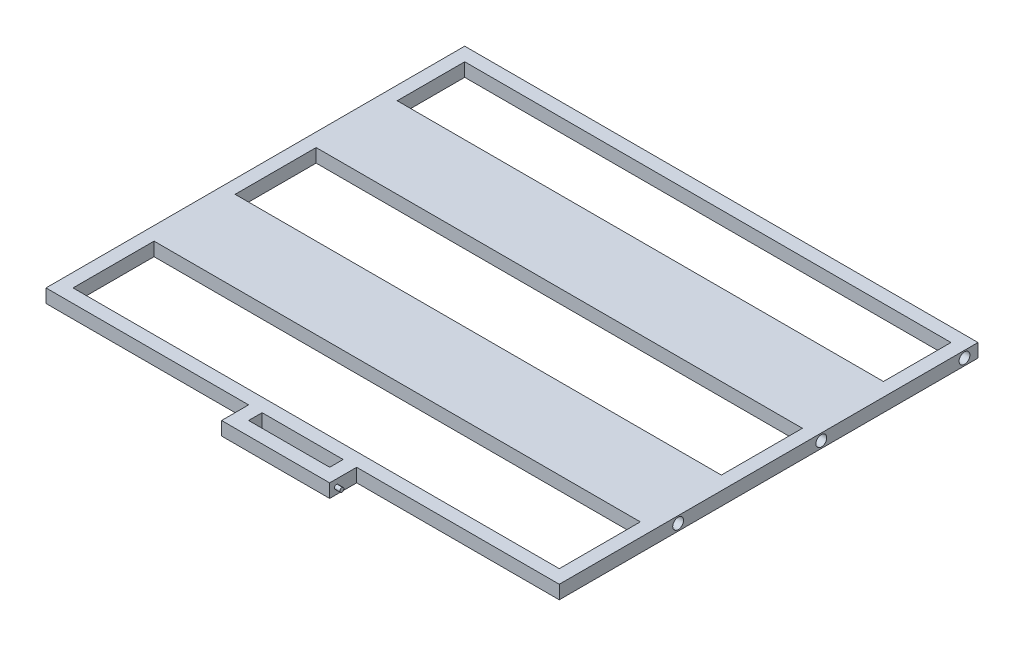
ISO-10303-21;
HEADER;
FILE_DESCRIPTION(('STEP AP214'),'2;1');
FILE_NAME('part.step','',(''),(''),'','','');
FILE_SCHEMA(('AUTOMOTIVE_DESIGN { 1 0 10303 214 1 1 1 1 }'));
ENDSEC;
DATA;
#1=APPLICATION_CONTEXT('core data for automotive mechanical design processes');
#2=APPLICATION_PROTOCOL_DEFINITION('international standard','automotive_design',2000,#1);
#3=PRODUCT_CONTEXT('',#1,'mechanical');
#4=PRODUCT('Part','Part','',(#3));
#5=PRODUCT_RELATED_PRODUCT_CATEGORY('part','',(#4));
#6=PRODUCT_DEFINITION_FORMATION('','',#4);
#7=PRODUCT_DEFINITION_CONTEXT('part definition',#1,'design');
#8=PRODUCT_DEFINITION('design','',#6,#7);
#9=PRODUCT_DEFINITION_SHAPE('','',#8);
#10=(LENGTH_UNIT() NAMED_UNIT(*) SI_UNIT(.MILLI.,.METRE.));
#11=(NAMED_UNIT(*) PLANE_ANGLE_UNIT() SI_UNIT($,.RADIAN.));
#12=(NAMED_UNIT(*) SI_UNIT($,.STERADIAN.) SOLID_ANGLE_UNIT());
#13=UNCERTAINTY_MEASURE_WITH_UNIT(LENGTH_MEASURE(1.E-05),#10,'distance_accuracy_value','');
#14=(GEOMETRIC_REPRESENTATION_CONTEXT(3) GLOBAL_UNCERTAINTY_ASSIGNED_CONTEXT((#13)) GLOBAL_UNIT_ASSIGNED_CONTEXT((#10,
#11,#12)) REPRESENTATION_CONTEXT('',''));
#15=CARTESIAN_POINT('',(0.,0.,0.));
#16=DIRECTION('',(0.,0.,1.));
#17=DIRECTION('',(1.,0.,0.));
#18=AXIS2_PLACEMENT_3D('',#15,#16,#17);
#19=CARTESIAN_POINT('',(450.,25.,0.));
#20=DIRECTION('',(-1.,0.,0.));
#21=DIRECTION('',(0.,0.,1.));
#22=AXIS2_PLACEMENT_3D('',#19,#20,#21);
#23=PLANE('',#22);
#24=DIRECTION('',(0.,0.,-1.));
#25=VECTOR('',#24,1.);
#26=CARTESIAN_POINT('',(450.,25.,0.));
#27=LINE('',#26,#25);
#28=CARTESIAN_POINT('',(450.000000000001,25.,-225.));
#29=VERTEX_POINT('',#28);
#30=CARTESIAN_POINT('',(450.,25.,-350.));
#31=VERTEX_POINT('',#30);
#32=EDGE_CURVE('E237',#29,#31,#27,.T.);
#33=ORIENTED_EDGE('',*,*,#32,.T.);
#34=DIRECTION('',(0.,-1.,0.));
#35=VECTOR('',#34,1.);
#36=CARTESIAN_POINT('',(450.,25.,-350.));
#37=LINE('',#36,#35);
#38=CARTESIAN_POINT('',(450.,0.,-350.));
#39=VERTEX_POINT('',#38);
#40=EDGE_CURVE('E390',#31,#39,#37,.T.);
#41=ORIENTED_EDGE('',*,*,#40,.T.);
#42=DIRECTION('',(0.,0.,-1.));
#43=VECTOR('',#42,1.);
#44=CARTESIAN_POINT('',(450.,0.,0.));
#45=LINE('',#44,#43);
#46=CARTESIAN_POINT('',(450.000000000001,0.,-225.));
#47=VERTEX_POINT('',#46);
#48=EDGE_CURVE('E284',#47,#39,#45,.T.);
#49=ORIENTED_EDGE('',*,*,#48,.F.);
#50=DIRECTION('',(0.,-1.,0.));
#51=VECTOR('',#50,1.);
#52=CARTESIAN_POINT('',(450.000000000001,25.,-225.));
#53=LINE('',#52,#51);
#54=EDGE_CURVE('E325',#29,#47,#53,.T.);
#55=ORIENTED_EDGE('',*,*,#54,.F.);
#56=EDGE_LOOP('',(#33,#41,#49,#55));
#57=FACE_BOUND('',#56,.T.);
#58=ADVANCED_FACE('F35',(#57),#23,.T.);
#59=CARTESIAN_POINT('',(-450.,25.,0.));
#60=DIRECTION('',(-1.,0.,0.));
#61=DIRECTION('',(0.,0.,1.));
#62=AXIS2_PLACEMENT_3D('',#59,#60,#61);
#63=PLANE('',#62);
#64=DIRECTION('',(0.,-1.,0.));
#65=VECTOR('',#64,1.);
#66=CARTESIAN_POINT('',(-450.,0.,-350.));
#67=LINE('',#66,#65);
#68=CARTESIAN_POINT('',(-450.,25.,-350.));
#69=VERTEX_POINT('',#68);
#70=CARTESIAN_POINT('',(-450.,0.,-350.));
#71=VERTEX_POINT('',#70);
#72=EDGE_CURVE('E60',#69,#71,#67,.T.);
#73=ORIENTED_EDGE('',*,*,#72,.F.);
#74=DIRECTION('',(0.,0.,-1.));
#75=VECTOR('',#74,1.);
#76=CARTESIAN_POINT('',(-450.,25.,0.));
#77=LINE('',#76,#75);
#78=CARTESIAN_POINT('',(-449.999999999999,25.,-225.));
#79=VERTEX_POINT('',#78);
#80=EDGE_CURVE('E245',#79,#69,#77,.T.);
#81=ORIENTED_EDGE('',*,*,#80,.F.);
#82=DIRECTION('',(0.,-1.,0.));
#83=VECTOR('',#82,1.);
#84=CARTESIAN_POINT('',(-449.999999999999,25.,-225.));
#85=LINE('',#84,#83);
#86=CARTESIAN_POINT('',(-449.999999999999,0.,-225.));
#87=VERTEX_POINT('',#86);
#88=EDGE_CURVE('E331',#79,#87,#85,.T.);
#89=ORIENTED_EDGE('',*,*,#88,.T.);
#90=DIRECTION('',(0.,0.,-1.));
#91=VECTOR('',#90,1.);
#92=CARTESIAN_POINT('',(-450.,0.,0.));
#93=LINE('',#92,#91);
#94=EDGE_CURVE('E292',#87,#71,#93,.T.);
#95=ORIENTED_EDGE('',*,*,#94,.T.);
#96=EDGE_LOOP('',(#73,#81,#89,#95));
#97=FACE_BOUND('',#96,.T.);
#98=ADVANCED_FACE('F456',(#97),#63,.F.);
#99=CARTESIAN_POINT('',(75.,25.,0.));
#100=DIRECTION('',(1.,0.,0.));
#101=DIRECTION('',(0.,0.,-1.));
#102=AXIS2_PLACEMENT_3D('',#99,#100,#101);
#103=PLANE('',#102);
#104=DIRECTION('',(0.,0.,1.));
#105=VECTOR('',#104,1.);
#106=CARTESIAN_POINT('',(75.,0.,0.));
#107=LINE('',#106,#105);
#108=CARTESIAN_POINT('',(75.,0.,400.));
#109=VERTEX_POINT('',#108);
#110=CARTESIAN_POINT('',(75.,0.,425.));
#111=VERTEX_POINT('',#110);
#112=EDGE_CURVE('E304',#109,#111,#107,.T.);
#113=ORIENTED_EDGE('',*,*,#112,.T.);
#114=DIRECTION('',(0.,-1.,0.));
#115=VECTOR('',#114,1.);
#116=CARTESIAN_POINT('',(75.,25.,425.));
#117=LINE('',#116,#115);
#118=CARTESIAN_POINT('',(75.,25.,425.));
#119=VERTEX_POINT('',#118);
#120=EDGE_CURVE('E44',#119,#111,#117,.T.);
#121=ORIENTED_EDGE('',*,*,#120,.F.);
#122=DIRECTION('',(0.,0.,1.));
#123=VECTOR('',#122,1.);
#124=CARTESIAN_POINT('',(75.,25.,0.));
#125=LINE('',#124,#123);
#126=CARTESIAN_POINT('',(75.,25.,400.));
#127=VERTEX_POINT('',#126);
#128=EDGE_CURVE('E255',#127,#119,#125,.T.);
#129=ORIENTED_EDGE('',*,*,#128,.F.);
#130=DIRECTION('',(0.,-1.,0.));
#131=VECTOR('',#130,1.);
#132=CARTESIAN_POINT('',(75.,25.,400.));
#133=LINE('',#132,#131);
#134=EDGE_CURVE('E313',#127,#109,#133,.T.);
#135=ORIENTED_EDGE('',*,*,#134,.T.);
#136=EDGE_LOOP('',(#113,#121,#129,#135));
#137=FACE_BOUND('',#136,.T.);
#138=ADVANCED_FACE('F431',(#137),#103,.F.);
#139=CARTESIAN_POINT('',(0.,25.,425.));
#140=DIRECTION('',(0.,0.,-1.));
#141=DIRECTION('',(-1.,0.,0.));
#142=AXIS2_PLACEMENT_3D('',#139,#140,#141);
#143=PLANE('',#142);
#144=DIRECTION('',(1.,0.,0.));
#145=VECTOR('',#144,1.);
#146=CARTESIAN_POINT('',(0.,0.,425.));
#147=LINE('',#146,#145);
#148=CARTESIAN_POINT('',(-75.,0.,425.));
#149=VERTEX_POINT('',#148);
#150=EDGE_CURVE('E307',#149,#111,#147,.T.);
#151=ORIENTED_EDGE('',*,*,#150,.F.);
#152=DIRECTION('',(0.,-1.,0.));
#153=VECTOR('',#152,1.);
#154=CARTESIAN_POINT('',(-75.,25.,425.));
#155=LINE('',#154,#153);
#156=CARTESIAN_POINT('',(-75.,25.,425.));
#157=VERTEX_POINT('',#156);
#158=EDGE_CURVE('E319',#157,#149,#155,.T.);
#159=ORIENTED_EDGE('',*,*,#158,.F.);
#160=DIRECTION('',(1.,0.,0.));
#161=VECTOR('',#160,1.);
#162=CARTESIAN_POINT('',(0.,25.,425.));
#163=LINE('',#162,#161);
#164=EDGE_CURVE('E257',#157,#119,#163,.T.);
#165=ORIENTED_EDGE('',*,*,#164,.T.);
#166=ORIENTED_EDGE('',*,*,#120,.T.);
#167=EDGE_LOOP('',(#151,#159,#165,#166));
#168=FACE_BOUND('',#167,.T.);
#169=ADVANCED_FACE('F436',(#168),#143,.T.);
#170=CARTESIAN_POINT('',(-75.,25.,0.));
#171=DIRECTION('',(1.,0.,0.));
#172=DIRECTION('',(0.,0.,-1.));
#173=AXIS2_PLACEMENT_3D('',#170,#171,#172);
#174=PLANE('',#173);
#175=DIRECTION('',(0.,0.,1.));
#176=VECTOR('',#175,1.);
#177=CARTESIAN_POINT('',(-75.,0.,0.));
#178=LINE('',#177,#176);
#179=CARTESIAN_POINT('',(-75.,0.,400.));
#180=VERTEX_POINT('',#179);
#181=EDGE_CURVE('E310',#180,#149,#178,.T.);
#182=ORIENTED_EDGE('',*,*,#181,.F.);
#183=DIRECTION('',(0.,-1.,0.));
#184=VECTOR('',#183,1.);
#185=CARTESIAN_POINT('',(-75.,25.,400.));
#186=LINE('',#185,#184);
#187=CARTESIAN_POINT('',(-75.,25.,400.));
#188=VERTEX_POINT('',#187);
#189=EDGE_CURVE('E316',#188,#180,#186,.T.);
#190=ORIENTED_EDGE('',*,*,#189,.F.);
#191=DIRECTION('',(0.,0.,1.));
#192=VECTOR('',#191,1.);
#193=CARTESIAN_POINT('',(-75.,25.,0.));
#194=LINE('',#193,#192);
#195=EDGE_CURVE('E260',#188,#157,#194,.T.);
#196=ORIENTED_EDGE('',*,*,#195,.T.);
#197=ORIENTED_EDGE('',*,*,#158,.T.);
#198=EDGE_LOOP('',(#182,#190,#196,#197));
#199=FACE_BOUND('',#198,.T.);
#200=ADVANCED_FACE('F441',(#199),#174,.T.);
#201=CARTESIAN_POINT('',(450.,0.,375.));
#202=VERTEX_POINT('',#201);
#203=CARTESIAN_POINT('',(450.,0.,225.));
#204=VERTEX_POINT('',#203);
#205=EDGE_CURVE('E283',#202,#204,#45,.T.);
#206=ORIENTED_EDGE('',*,*,#205,.F.);
#207=DIRECTION('',(0.,-1.,0.));
#208=VECTOR('',#207,1.);
#209=CARTESIAN_POINT('',(450.,25.,375.));
#210=LINE('',#209,#208);
#211=CARTESIAN_POINT('',(450.,25.,375.));
#212=VERTEX_POINT('',#211);
#213=EDGE_CURVE('E317',#212,#202,#210,.T.);
#214=ORIENTED_EDGE('',*,*,#213,.F.);
#215=CARTESIAN_POINT('',(450.,25.,225.));
#216=VERTEX_POINT('',#215);
#217=EDGE_CURVE('E236',#212,#216,#27,.T.);
#218=ORIENTED_EDGE('',*,*,#217,.T.);
#219=DIRECTION('',(0.,-1.,0.));
#220=VECTOR('',#219,1.);
#221=CARTESIAN_POINT('',(450.,25.,225.));
#222=LINE('',#221,#220);
#223=EDGE_CURVE('E322',#216,#204,#222,.T.);
#224=ORIENTED_EDGE('',*,*,#223,.T.);
#225=EDGE_LOOP('',(#206,#214,#218,#224));
#226=FACE_BOUND('',#225,.T.);
#227=ADVANCED_FACE('F443',(#226),#23,.T.);
#228=CARTESIAN_POINT('',(0.,25.,375.));
#229=DIRECTION('',(0.,0.,-1.));
#230=DIRECTION('',(-1.,0.,0.));
#231=AXIS2_PLACEMENT_3D('',#228,#229,#230);
#232=PLANE('',#231);
#233=DIRECTION('',(1.,0.,0.));
#234=VECTOR('',#233,1.);
#235=CARTESIAN_POINT('',(0.,0.,375.));
#236=LINE('',#235,#234);
#237=CARTESIAN_POINT('',(-450.,0.,375.));
#238=VERTEX_POINT('',#237);
#239=EDGE_CURVE('E298',#238,#202,#236,.T.);
#240=ORIENTED_EDGE('',*,*,#239,.F.);
#241=DIRECTION('',(0.,-1.,0.));
#242=VECTOR('',#241,1.);
#243=CARTESIAN_POINT('',(-450.,25.,375.));
#244=LINE('',#243,#242);
#245=CARTESIAN_POINT('',(-450.,25.,375.));
#246=VERTEX_POINT('',#245);
#247=EDGE_CURVE('E328',#246,#238,#244,.T.);
#248=ORIENTED_EDGE('',*,*,#247,.F.);
#249=DIRECTION('',(1.,0.,0.));
#250=VECTOR('',#249,1.);
#251=CARTESIAN_POINT('',(0.,25.,375.));
#252=LINE('',#251,#250);
#253=EDGE_CURVE('E250',#246,#212,#252,.T.);
#254=ORIENTED_EDGE('',*,*,#253,.T.);
#255=ORIENTED_EDGE('',*,*,#213,.T.);
#256=EDGE_LOOP('',(#240,#248,#254,#255));
#257=FACE_BOUND('',#256,.T.);
#258=ADVANCED_FACE('F449',(#257),#232,.T.);
#259=CARTESIAN_POINT('',(-450.,0.,225.));
#260=VERTEX_POINT('',#259);
#261=EDGE_CURVE('E291',#238,#260,#93,.T.);
#262=ORIENTED_EDGE('',*,*,#261,.T.);
#263=DIRECTION('',(0.,-1.,0.));
#264=VECTOR('',#263,1.);
#265=CARTESIAN_POINT('',(-450.,25.,225.));
#266=LINE('',#265,#264);
#267=CARTESIAN_POINT('',(-450.,25.,225.));
#268=VERTEX_POINT('',#267);
#269=EDGE_CURVE('E324',#268,#260,#266,.T.);
#270=ORIENTED_EDGE('',*,*,#269,.F.);
#271=EDGE_CURVE('E244',#246,#268,#77,.T.);
#272=ORIENTED_EDGE('',*,*,#271,.F.);
#273=ORIENTED_EDGE('',*,*,#247,.T.);
#274=EDGE_LOOP('',(#262,#270,#272,#273));
#275=FACE_BOUND('',#274,.T.);
#276=ADVANCED_FACE('F463',(#275),#63,.F.);
#277=CARTESIAN_POINT('',(0.,25.,-225.));
#278=DIRECTION('',(0.,0.,-1.));
#279=DIRECTION('',(-1.,0.,0.));
#280=AXIS2_PLACEMENT_3D('',#277,#278,#279);
#281=PLANE('',#280);
#282=DIRECTION('',(1.,0.,0.));
#283=VECTOR('',#282,1.);
#284=CARTESIAN_POINT('',(0.,0.,-225.));
#285=LINE('',#284,#283);
#286=EDGE_CURVE('E295',#87,#47,#285,.T.);
#287=ORIENTED_EDGE('',*,*,#286,.F.);
#288=ORIENTED_EDGE('',*,*,#88,.F.);
#289=DIRECTION('',(1.,0.,0.));
#290=VECTOR('',#289,1.);
#291=CARTESIAN_POINT('',(0.,25.,-225.));
#292=LINE('',#291,#290);
#293=EDGE_CURVE('E247',#79,#29,#292,.T.);
#294=ORIENTED_EDGE('',*,*,#293,.T.);
#295=ORIENTED_EDGE('',*,*,#54,.T.);
#296=EDGE_LOOP('',(#287,#288,#294,#295));
#297=FACE_BOUND('',#296,.T.);
#298=ADVANCED_FACE('F468',(#297),#281,.T.);
#299=CARTESIAN_POINT('',(450.,0.,75.0000000000001));
#300=VERTEX_POINT('',#299);
#301=CARTESIAN_POINT('',(450.,0.,-74.9999999999999));
#302=VERTEX_POINT('',#301);
#303=EDGE_CURVE('E279',#300,#302,#45,.T.);
#304=ORIENTED_EDGE('',*,*,#303,.F.);
#305=DIRECTION('',(0.,-1.,0.));
#306=VECTOR('',#305,1.);
#307=CARTESIAN_POINT('',(450.,25.,75.0000000000001));
#308=LINE('',#307,#306);
#309=CARTESIAN_POINT('',(450.,25.,75.0000000000001));
#310=VERTEX_POINT('',#309);
#311=EDGE_CURVE('E333',#310,#300,#308,.T.);
#312=ORIENTED_EDGE('',*,*,#311,.F.);
#313=CARTESIAN_POINT('',(450.,25.,-74.9999999999999));
#314=VERTEX_POINT('',#313);
#315=EDGE_CURVE('E232',#310,#314,#27,.T.);
#316=ORIENTED_EDGE('',*,*,#315,.T.);
#317=DIRECTION('',(0.,-1.,0.));
#318=VECTOR('',#317,1.);
#319=CARTESIAN_POINT('',(450.,25.,-74.9999999999999));
#320=LINE('',#319,#318);
#321=EDGE_CURVE('E335',#314,#302,#320,.T.);
#322=ORIENTED_EDGE('',*,*,#321,.T.);
#323=EDGE_LOOP('',(#304,#312,#316,#322));
#324=FACE_BOUND('',#323,.T.);
#325=ADVANCED_FACE('F452',(#324),#23,.T.);
#326=CARTESIAN_POINT('',(0.,25.,75.0000000000001));
#327=DIRECTION('',(0.,0.,-1.));
#328=DIRECTION('',(-1.,0.,0.));
#329=AXIS2_PLACEMENT_3D('',#326,#327,#328);
#330=PLANE('',#329);
#331=DIRECTION('',(1.,0.,0.));
#332=VECTOR('',#331,1.);
#333=CARTESIAN_POINT('',(0.,0.,75.0000000000001));
#334=LINE('',#333,#332);
#335=CARTESIAN_POINT('',(-450.,0.,75.0000000000001));
#336=VERTEX_POINT('',#335);
#337=EDGE_CURVE('E282',#336,#300,#334,.T.);
#338=ORIENTED_EDGE('',*,*,#337,.F.);
#339=DIRECTION('',(0.,-1.,0.));
#340=VECTOR('',#339,1.);
#341=CARTESIAN_POINT('',(-450.,25.,75.0000000000001));
#342=LINE('',#341,#340);
#343=CARTESIAN_POINT('',(-450.,25.,75.0000000000001));
#344=VERTEX_POINT('',#343);
#345=EDGE_CURVE('E341',#344,#336,#342,.T.);
#346=ORIENTED_EDGE('',*,*,#345,.F.);
#347=DIRECTION('',(1.,0.,0.));
#348=VECTOR('',#347,1.);
#349=CARTESIAN_POINT('',(0.,25.,75.0000000000001));
#350=LINE('',#349,#348);
#351=EDGE_CURVE('E235',#344,#310,#350,.T.);
#352=ORIENTED_EDGE('',*,*,#351,.T.);
#353=ORIENTED_EDGE('',*,*,#311,.T.);
#354=EDGE_LOOP('',(#338,#346,#352,#353));
#355=FACE_BOUND('',#354,.T.);
#356=ADVANCED_FACE('F467',(#355),#330,.T.);
#357=CARTESIAN_POINT('',(-450.,0.,-74.9999999999999));
#358=VERTEX_POINT('',#357);
#359=EDGE_CURVE('E287',#336,#358,#93,.T.);
#360=ORIENTED_EDGE('',*,*,#359,.T.);
#361=DIRECTION('',(0.,-1.,0.));
#362=VECTOR('',#361,1.);
#363=CARTESIAN_POINT('',(-450.,25.,-74.9999999999999));
#364=LINE('',#363,#362);
#365=CARTESIAN_POINT('',(-450.,25.,-74.9999999999999));
#366=VERTEX_POINT('',#365);
#367=EDGE_CURVE('E337',#366,#358,#364,.T.);
#368=ORIENTED_EDGE('',*,*,#367,.F.);
#369=EDGE_CURVE('E240',#344,#366,#77,.T.);
#370=ORIENTED_EDGE('',*,*,#369,.F.);
#371=ORIENTED_EDGE('',*,*,#345,.T.);
#372=EDGE_LOOP('',(#360,#368,#370,#371));
#373=FACE_BOUND('',#372,.T.);
#374=ADVANCED_FACE('F462',(#373),#63,.F.);
#375=CARTESIAN_POINT('',(0.,25.,450.));
#376=DIRECTION('',(0.,0.,-1.));
#377=DIRECTION('',(-1.,0.,0.));
#378=AXIS2_PLACEMENT_3D('',#375,#376,#377);
#379=PLANE('',#378);
#380=DIRECTION('',(1.,0.,0.));
#381=VECTOR('',#380,1.);
#382=CARTESIAN_POINT('',(0.,0.,450.));
#383=LINE('',#382,#381);
#384=CARTESIAN_POINT('',(-100.,0.,450.));
#385=VERTEX_POINT('',#384);
#386=CARTESIAN_POINT('',(100.,0.,450.));
#387=VERTEX_POINT('',#386);
#388=EDGE_CURVE('E263',#385,#387,#383,.T.);
#389=ORIENTED_EDGE('',*,*,#388,.T.);
#390=DIRECTION('',(0.,-1.,0.));
#391=VECTOR('',#390,1.);
#392=CARTESIAN_POINT('',(100.,25.,450.));
#393=LINE('',#392,#391);
#394=CARTESIAN_POINT('',(100.,25.,450.));
#395=VERTEX_POINT('',#394);
#396=EDGE_CURVE('E338',#395,#387,#393,.T.);
#397=ORIENTED_EDGE('',*,*,#396,.F.);
#398=DIRECTION('',(1.,0.,0.));
#399=VECTOR('',#398,1.);
#400=CARTESIAN_POINT('',(0.,25.,450.));
#401=LINE('',#400,#399);
#402=CARTESIAN_POINT('',(-100.,25.,450.));
#403=VERTEX_POINT('',#402);
#404=EDGE_CURVE('E394',#403,#395,#401,.T.);
#405=ORIENTED_EDGE('',*,*,#404,.F.);
#406=DIRECTION('',(0.,-1.,0.));
#407=VECTOR('',#406,1.);
#408=CARTESIAN_POINT('',(-100.,25.,450.));
#409=LINE('',#408,#407);
#410=EDGE_CURVE('E344',#403,#385,#409,.T.);
#411=ORIENTED_EDGE('',*,*,#410,.T.);
#412=EDGE_LOOP('',(#389,#397,#405,#411));
#413=FACE_BOUND('',#412,.T.);
#414=ADVANCED_FACE('F37',(#413),#379,.F.);
#415=CARTESIAN_POINT('',(100.,25.,0.));
#416=DIRECTION('',(-1.,0.,0.));
#417=DIRECTION('',(0.,0.,1.));
#418=AXIS2_PLACEMENT_3D('',#415,#416,#417);
#419=PLANE('',#418);
#420=CARTESIAN_POINT('',(100.,12.5,437.5));
#421=DIRECTION('',(-1.,0.,0.));
#422=DIRECTION('',(0.,0.,1.));
#423=AXIS2_PLACEMENT_3D('',#420,#421,#422);
#424=CIRCLE('',#423,3.74999999999998);
#425=CARTESIAN_POINT('',(100.,12.5,441.25));
#426=VERTEX_POINT('',#425);
#427=EDGE_CURVE('E11',#426,#426,#424,.F.);
#428=ORIENTED_EDGE('',*,*,#427,.F.);
#429=EDGE_LOOP('',(#428));
#430=FACE_BOUND('',#429,.T.);
#431=DIRECTION('',(0.,0.,-1.));
#432=VECTOR('',#431,1.);
#433=CARTESIAN_POINT('',(100.,0.,0.));
#434=LINE('',#433,#432);
#435=CARTESIAN_POINT('',(100.,0.,400.));
#436=VERTEX_POINT('',#435);
#437=EDGE_CURVE('E266',#387,#436,#434,.T.);
#438=ORIENTED_EDGE('',*,*,#437,.T.);
#439=DIRECTION('',(0.,-1.,0.));
#440=VECTOR('',#439,1.);
#441=CARTESIAN_POINT('',(100.,25.,400.));
#442=LINE('',#441,#440);
#443=CARTESIAN_POINT('',(100.,25.,400.));
#444=VERTEX_POINT('',#443);
#445=EDGE_CURVE('E354',#444,#436,#442,.T.);
#446=ORIENTED_EDGE('',*,*,#445,.F.);
#447=DIRECTION('',(0.,0.,-1.));
#448=VECTOR('',#447,1.);
#449=CARTESIAN_POINT('',(100.,25.,0.));
#450=LINE('',#449,#448);
#451=EDGE_CURVE('E225',#395,#444,#450,.T.);
#452=ORIENTED_EDGE('',*,*,#451,.F.);
#453=ORIENTED_EDGE('',*,*,#396,.T.);
#454=EDGE_LOOP('',(#438,#446,#452,#453));
#455=FACE_BOUND('',#454,.T.);
#456=ADVANCED_FACE('F400',(#430,#455),#419,.F.);
#457=CARTESIAN_POINT('',(0.,25.,400.));
#458=DIRECTION('',(0.,0.,-1.));
#459=DIRECTION('',(-1.,0.,0.));
#460=AXIS2_PLACEMENT_3D('',#457,#458,#459);
#461=PLANE('',#460);
#462=DIRECTION('',(1.,0.,0.));
#463=VECTOR('',#462,1.);
#464=CARTESIAN_POINT('',(0.,0.,400.));
#465=LINE('',#464,#463);
#466=CARTESIAN_POINT('',(475.,0.,400.));
#467=VERTEX_POINT('',#466);
#468=EDGE_CURVE('E269',#436,#467,#465,.T.);
#469=ORIENTED_EDGE('',*,*,#468,.T.);
#470=DIRECTION('',(0.,-1.,0.));
#471=VECTOR('',#470,1.);
#472=CARTESIAN_POINT('',(475.,25.,400.));
#473=LINE('',#472,#471);
#474=CARTESIAN_POINT('',(475.,25.,400.));
#475=VERTEX_POINT('',#474);
#476=EDGE_CURVE('E352',#475,#467,#473,.T.);
#477=ORIENTED_EDGE('',*,*,#476,.F.);
#478=DIRECTION('',(1.,0.,0.));
#479=VECTOR('',#478,1.);
#480=CARTESIAN_POINT('',(0.,25.,400.));
#481=LINE('',#480,#479);
#482=EDGE_CURVE('E219',#444,#475,#481,.T.);
#483=ORIENTED_EDGE('',*,*,#482,.F.);
#484=ORIENTED_EDGE('',*,*,#445,.T.);
#485=EDGE_LOOP('',(#469,#477,#483,#484));
#486=FACE_BOUND('',#485,.T.);
#487=ADVANCED_FACE('F403',(#486),#461,.F.);
#488=CARTESIAN_POINT('',(475.,25.,0.));
#489=DIRECTION('',(-1.,0.,0.));
#490=DIRECTION('',(0.,0.,1.));
#491=AXIS2_PLACEMENT_3D('',#488,#489,#490);
#492=PLANE('',#491);
#493=CARTESIAN_POINT('',(475.,12.5,-350.));
#494=DIRECTION('',(1.,0.,0.));
#495=DIRECTION('',(0.,0.,-1.));
#496=AXIS2_PLACEMENT_3D('',#493,#494,#495);
#497=CIRCLE('',#496,10.);
#498=CARTESIAN_POINT('',(475.,12.5,-360.));
#499=VERTEX_POINT('',#498);
#500=EDGE_CURVE('E906',#499,#499,#497,.T.);
#501=ORIENTED_EDGE('',*,*,#500,.F.);
#502=EDGE_LOOP('',(#501));
#503=FACE_BOUND('',#502,.T.);
#504=CARTESIAN_POINT('',(475.,12.4999999999981,-84.9999999999999));
#505=DIRECTION('',(1.,0.,0.));
#506=DIRECTION('',(0.,0.,-1.));
#507=AXIS2_PLACEMENT_3D('',#504,#505,#506);
#508=CIRCLE('',#507,10.);
#509=CARTESIAN_POINT('',(475.,12.4999999999981,-94.9999999999999));
#510=VERTEX_POINT('',#509);
#511=EDGE_CURVE('E376',#510,#510,#508,.T.);
#512=ORIENTED_EDGE('',*,*,#511,.F.);
#513=EDGE_LOOP('',(#512));
#514=FACE_BOUND('',#513,.T.);
#515=CARTESIAN_POINT('',(475.,12.4999999999963,180.));
#516=DIRECTION('',(1.,0.,0.));
#517=DIRECTION('',(0.,0.,-1.));
#518=AXIS2_PLACEMENT_3D('',#515,#516,#517);
#519=CIRCLE('',#518,10.);
#520=CARTESIAN_POINT('',(475.,12.4999999999963,170.));
#521=VERTEX_POINT('',#520);
#522=EDGE_CURVE('E367',#521,#521,#519,.T.);
#523=ORIENTED_EDGE('',*,*,#522,.F.);
#524=EDGE_LOOP('',(#523));
#525=FACE_BOUND('',#524,.T.);
#526=DIRECTION('',(0.,0.,-1.));
#527=VECTOR('',#526,1.);
#528=CARTESIAN_POINT('',(475.,0.,0.));
#529=LINE('',#528,#527);
#530=CARTESIAN_POINT('',(475.,0.,-375.));
#531=VERTEX_POINT('',#530);
#532=EDGE_CURVE('E214',#467,#531,#529,.T.);
#533=ORIENTED_EDGE('',*,*,#532,.T.);
#534=DIRECTION('',(0.,1.,0.));
#535=VECTOR('',#534,1.);
#536=CARTESIAN_POINT('',(475.,25.,-375.));
#537=LINE('',#536,#535);
#538=CARTESIAN_POINT('',(475.,25.,-375.));
#539=VERTEX_POINT('',#538);
#540=EDGE_CURVE('E52',#531,#539,#537,.T.);
#541=ORIENTED_EDGE('',*,*,#540,.T.);
#542=DIRECTION('',(0.,0.,-1.));
#543=VECTOR('',#542,1.);
#544=CARTESIAN_POINT('',(475.,25.,0.));
#545=LINE('',#544,#543);
#546=EDGE_CURVE('E212',#475,#539,#545,.T.);
#547=ORIENTED_EDGE('',*,*,#546,.F.);
#548=ORIENTED_EDGE('',*,*,#476,.T.);
#549=EDGE_LOOP('',(#533,#541,#547,#548));
#550=FACE_BOUND('',#549,.T.);
#551=ADVANCED_FACE('F210',(#503,#514,#525,#550),#492,.F.);
#552=CARTESIAN_POINT('',(-475.,25.,0.));
#553=DIRECTION('',(-1.,0.,0.));
#554=DIRECTION('',(0.,0.,1.));
#555=AXIS2_PLACEMENT_3D('',#552,#553,#554);
#556=PLANE('',#555);
#557=CARTESIAN_POINT('',(-475.,12.5,-350.));
#558=DIRECTION('',(-1.,0.,0.));
#559=DIRECTION('',(0.,0.,1.));
#560=AXIS2_PLACEMENT_3D('',#557,#558,#559);
#561=CIRCLE('',#560,10.);
#562=CARTESIAN_POINT('',(-475.,12.5,-340.));
#563=VERTEX_POINT('',#562);
#564=EDGE_CURVE('E39',#563,#563,#561,.F.);
#565=ORIENTED_EDGE('',*,*,#564,.T.);
#566=EDGE_LOOP('',(#565));
#567=FACE_BOUND('',#566,.T.);
#568=CARTESIAN_POINT('',(-475.,12.4999999999981,-84.9999999999999));
#569=DIRECTION('',(-1.,0.,0.));
#570=DIRECTION('',(0.,0.,1.));
#571=AXIS2_PLACEMENT_3D('',#568,#569,#570);
#572=CIRCLE('',#571,10.);
#573=CARTESIAN_POINT('',(-475.,12.4999999999981,-74.9999999999999));
#574=VERTEX_POINT('',#573);
#575=EDGE_CURVE('E361',#574,#574,#572,.F.);
#576=ORIENTED_EDGE('',*,*,#575,.T.);
#577=EDGE_LOOP('',(#576));
#578=FACE_BOUND('',#577,.T.);
#579=CARTESIAN_POINT('',(-475.,12.4999999999963,180.));
#580=DIRECTION('',(-1.,0.,0.));
#581=DIRECTION('',(0.,0.,1.));
#582=AXIS2_PLACEMENT_3D('',#579,#580,#581);
#583=CIRCLE('',#582,10.);
#584=CARTESIAN_POINT('',(-475.,12.4999999999963,190.));
#585=VERTEX_POINT('',#584);
#586=EDGE_CURVE('E359',#585,#585,#583,.F.);
#587=ORIENTED_EDGE('',*,*,#586,.T.);
#588=EDGE_LOOP('',(#587));
#589=FACE_BOUND('',#588,.T.);
#590=DIRECTION('',(0.,1.,0.));
#591=VECTOR('',#590,1.);
#592=CARTESIAN_POINT('',(-475.,25.,-375.));
#593=LINE('',#592,#591);
#594=CARTESIAN_POINT('',(-475.,0.,-375.));
#595=VERTEX_POINT('',#594);
#596=CARTESIAN_POINT('',(-475.,25.,-375.));
#597=VERTEX_POINT('',#596);
#598=EDGE_CURVE('E200',#595,#597,#593,.T.);
#599=ORIENTED_EDGE('',*,*,#598,.F.);
#600=DIRECTION('',(0.,0.,-1.));
#601=VECTOR('',#600,1.);
#602=CARTESIAN_POINT('',(-475.,0.,0.));
#603=LINE('',#602,#601);
#604=CARTESIAN_POINT('',(-475.,0.,400.));
#605=VERTEX_POINT('',#604);
#606=EDGE_CURVE('E274',#605,#595,#603,.T.);
#607=ORIENTED_EDGE('',*,*,#606,.F.);
#608=DIRECTION('',(0.,-1.,0.));
#609=VECTOR('',#608,1.);
#610=CARTESIAN_POINT('',(-475.,25.,400.));
#611=LINE('',#610,#609);
#612=CARTESIAN_POINT('',(-475.,25.,400.));
#613=VERTEX_POINT('',#612);
#614=EDGE_CURVE('E350',#613,#605,#611,.T.);
#615=ORIENTED_EDGE('',*,*,#614,.F.);
#616=DIRECTION('',(0.,0.,-1.));
#617=VECTOR('',#616,1.);
#618=CARTESIAN_POINT('',(-475.,25.,0.));
#619=LINE('',#618,#617);
#620=EDGE_CURVE('E221',#613,#597,#619,.T.);
#621=ORIENTED_EDGE('',*,*,#620,.T.);
#622=EDGE_LOOP('',(#599,#607,#615,#621));
#623=FACE_BOUND('',#622,.T.);
#624=ADVANCED_FACE('F410',(#567,#578,#589,#623),#556,.T.);
#625=CARTESIAN_POINT('',(-100.,0.,400.));
#626=VERTEX_POINT('',#625);
#627=EDGE_CURVE('E272',#605,#626,#465,.T.);
#628=ORIENTED_EDGE('',*,*,#627,.T.);
#629=DIRECTION('',(0.,-1.,0.));
#630=VECTOR('',#629,1.);
#631=CARTESIAN_POINT('',(-100.,25.,400.));
#632=LINE('',#631,#630);
#633=CARTESIAN_POINT('',(-100.,25.,400.));
#634=VERTEX_POINT('',#633);
#635=EDGE_CURVE('E347',#634,#626,#632,.T.);
#636=ORIENTED_EDGE('',*,*,#635,.F.);
#637=EDGE_CURVE('E223',#613,#634,#481,.T.);
#638=ORIENTED_EDGE('',*,*,#637,.F.);
#639=ORIENTED_EDGE('',*,*,#614,.T.);
#640=EDGE_LOOP('',(#628,#636,#638,#639));
#641=FACE_BOUND('',#640,.T.);
#642=ADVANCED_FACE('F416',(#641),#461,.F.);
#643=CARTESIAN_POINT('',(0.,25.,225.));
#644=DIRECTION('',(0.,0.,-1.));
#645=DIRECTION('',(-1.,0.,0.));
#646=AXIS2_PLACEMENT_3D('',#643,#644,#645);
#647=PLANE('',#646);
#648=DIRECTION('',(1.,0.,0.));
#649=VECTOR('',#648,1.);
#650=CARTESIAN_POINT('',(0.,0.,225.));
#651=LINE('',#650,#649);
#652=EDGE_CURVE('E301',#260,#204,#651,.T.);
#653=ORIENTED_EDGE('',*,*,#652,.T.);
#654=ORIENTED_EDGE('',*,*,#223,.F.);
#655=DIRECTION('',(1.,0.,0.));
#656=VECTOR('',#655,1.);
#657=CARTESIAN_POINT('',(0.,25.,225.));
#658=LINE('',#657,#656);
#659=EDGE_CURVE('E253',#268,#216,#658,.T.);
#660=ORIENTED_EDGE('',*,*,#659,.F.);
#661=ORIENTED_EDGE('',*,*,#269,.T.);
#662=EDGE_LOOP('',(#653,#654,#660,#661));
#663=FACE_BOUND('',#662,.T.);
#664=ADVANCED_FACE('F544',(#663),#647,.F.);
#665=CARTESIAN_POINT('',(0.,25.,-74.9999999999999));
#666=DIRECTION('',(0.,0.,-1.));
#667=DIRECTION('',(-1.,0.,0.));
#668=AXIS2_PLACEMENT_3D('',#665,#666,#667);
#669=PLANE('',#668);
#670=DIRECTION('',(1.,0.,0.));
#671=VECTOR('',#670,1.);
#672=CARTESIAN_POINT('',(0.,0.,-74.9999999999999));
#673=LINE('',#672,#671);
#674=EDGE_CURVE('E290',#358,#302,#673,.T.);
#675=ORIENTED_EDGE('',*,*,#674,.T.);
#676=ORIENTED_EDGE('',*,*,#321,.F.);
#677=DIRECTION('',(1.,0.,0.));
#678=VECTOR('',#677,1.);
#679=CARTESIAN_POINT('',(0.,25.,-74.9999999999999));
#680=LINE('',#679,#678);
#681=EDGE_CURVE('E243',#366,#314,#680,.T.);
#682=ORIENTED_EDGE('',*,*,#681,.F.);
#683=ORIENTED_EDGE('',*,*,#367,.T.);
#684=EDGE_LOOP('',(#675,#676,#682,#683));
#685=FACE_BOUND('',#684,.T.);
#686=ADVANCED_FACE('F489',(#685),#669,.F.);
#687=CARTESIAN_POINT('',(-100.,25.,0.));
#688=DIRECTION('',(1.,0.,0.));
#689=DIRECTION('',(0.,0.,-1.));
#690=AXIS2_PLACEMENT_3D('',#687,#688,#689);
#691=PLANE('',#690);
#692=DIRECTION('',(0.,0.,1.));
#693=VECTOR('',#692,1.);
#694=CARTESIAN_POINT('',(-100.,0.,0.));
#695=LINE('',#694,#693);
#696=EDGE_CURVE('E277',#626,#385,#695,.T.);
#697=ORIENTED_EDGE('',*,*,#696,.T.);
#698=ORIENTED_EDGE('',*,*,#410,.F.);
#699=DIRECTION('',(0.,0.,1.));
#700=VECTOR('',#699,1.);
#701=CARTESIAN_POINT('',(-100.,25.,0.));
#702=LINE('',#701,#700);
#703=EDGE_CURVE('E230',#634,#403,#702,.T.);
#704=ORIENTED_EDGE('',*,*,#703,.F.);
#705=ORIENTED_EDGE('',*,*,#635,.T.);
#706=EDGE_LOOP('',(#697,#698,#704,#705));
#707=FACE_BOUND('',#706,.T.);
#708=ADVANCED_FACE('F419',(#707),#691,.F.);
#709=EDGE_CURVE('E271',#180,#109,#465,.T.);
#710=ORIENTED_EDGE('',*,*,#709,.T.);
#711=ORIENTED_EDGE('',*,*,#134,.F.);
#712=EDGE_CURVE('E227',#188,#127,#481,.T.);
#713=ORIENTED_EDGE('',*,*,#712,.F.);
#714=ORIENTED_EDGE('',*,*,#189,.T.);
#715=EDGE_LOOP('',(#710,#711,#713,#714));
#716=FACE_BOUND('',#715,.T.);
#717=ADVANCED_FACE('F425',(#716),#461,.F.);
#718=CARTESIAN_POINT('',(0.,25.,0.));
#719=DIRECTION('',(0.,1.,0.));
#720=DIRECTION('',(0.,0.,1.));
#721=AXIS2_PLACEMENT_3D('',#718,#719,#720);
#722=PLANE('',#721);
#723=DIRECTION('',(-1.,0.,0.));
#724=VECTOR('',#723,1.);
#725=CARTESIAN_POINT('',(475.,25.,-375.));
#726=LINE('',#725,#724);
#727=EDGE_CURVE('E197',#539,#597,#726,.T.);
#728=ORIENTED_EDGE('',*,*,#727,.T.);
#729=ORIENTED_EDGE('',*,*,#620,.F.);
#730=ORIENTED_EDGE('',*,*,#637,.T.);
#731=ORIENTED_EDGE('',*,*,#703,.T.);
#732=ORIENTED_EDGE('',*,*,#404,.T.);
#733=ORIENTED_EDGE('',*,*,#451,.T.);
#734=ORIENTED_EDGE('',*,*,#482,.T.);
#735=ORIENTED_EDGE('',*,*,#546,.T.);
#736=EDGE_LOOP('',(#728,#729,#730,#731,#732,#733,#734,#735));
#737=FACE_BOUND('',#736,.T.);
#738=DIRECTION('',(-1.,0.,0.));
#739=VECTOR('',#738,1.);
#740=CARTESIAN_POINT('',(475.,25.,-350.));
#741=LINE('',#740,#739);
#742=EDGE_CURVE('E387',#31,#69,#741,.T.);
#743=ORIENTED_EDGE('',*,*,#742,.F.);
#744=ORIENTED_EDGE('',*,*,#32,.F.);
#745=ORIENTED_EDGE('',*,*,#293,.F.);
#746=ORIENTED_EDGE('',*,*,#80,.T.);
#747=EDGE_LOOP('',(#743,#744,#745,#746));
#748=FACE_BOUND('',#747,.T.);
#749=ORIENTED_EDGE('',*,*,#315,.F.);
#750=ORIENTED_EDGE('',*,*,#351,.F.);
#751=ORIENTED_EDGE('',*,*,#369,.T.);
#752=ORIENTED_EDGE('',*,*,#681,.T.);
#753=EDGE_LOOP('',(#749,#750,#751,#752));
#754=FACE_BOUND('',#753,.T.);
#755=ORIENTED_EDGE('',*,*,#217,.F.);
#756=ORIENTED_EDGE('',*,*,#253,.F.);
#757=ORIENTED_EDGE('',*,*,#271,.T.);
#758=ORIENTED_EDGE('',*,*,#659,.T.);
#759=EDGE_LOOP('',(#755,#756,#757,#758));
#760=FACE_BOUND('',#759,.T.);
#761=ORIENTED_EDGE('',*,*,#128,.T.);
#762=ORIENTED_EDGE('',*,*,#164,.F.);
#763=ORIENTED_EDGE('',*,*,#195,.F.);
#764=ORIENTED_EDGE('',*,*,#712,.T.);
#765=EDGE_LOOP('',(#761,#762,#763,#764));
#766=FACE_BOUND('',#765,.T.);
#767=ADVANCED_FACE('F216',(#737,#748,#754,#760,#766),#722,.T.);
#768=CARTESIAN_POINT('',(0.,0.,0.));
#769=DIRECTION('',(0.,1.,0.));
#770=DIRECTION('',(0.,0.,1.));
#771=AXIS2_PLACEMENT_3D('',#768,#769,#770);
#772=PLANE('',#771);
#773=ORIENTED_EDGE('',*,*,#48,.T.);
#774=DIRECTION('',(-1.,0.,0.));
#775=VECTOR('',#774,1.);
#776=CARTESIAN_POINT('',(475.,0.,-350.));
#777=LINE('',#776,#775);
#778=EDGE_CURVE('E384',#39,#71,#777,.T.);
#779=ORIENTED_EDGE('',*,*,#778,.T.);
#780=ORIENTED_EDGE('',*,*,#94,.F.);
#781=ORIENTED_EDGE('',*,*,#286,.T.);
#782=EDGE_LOOP('',(#773,#779,#780,#781));
#783=FACE_BOUND('',#782,.T.);
#784=ORIENTED_EDGE('',*,*,#606,.T.);
#785=DIRECTION('',(-1.,0.,0.));
#786=VECTOR('',#785,1.);
#787=CARTESIAN_POINT('',(475.,0.,-375.));
#788=LINE('',#787,#786);
#789=EDGE_CURVE('E205',#531,#595,#788,.T.);
#790=ORIENTED_EDGE('',*,*,#789,.F.);
#791=ORIENTED_EDGE('',*,*,#532,.F.);
#792=ORIENTED_EDGE('',*,*,#468,.F.);
#793=ORIENTED_EDGE('',*,*,#437,.F.);
#794=ORIENTED_EDGE('',*,*,#388,.F.);
#795=ORIENTED_EDGE('',*,*,#696,.F.);
#796=ORIENTED_EDGE('',*,*,#627,.F.);
#797=EDGE_LOOP('',(#784,#790,#791,#792,#793,#794,#795,#796));
#798=FACE_BOUND('',#797,.T.);
#799=ORIENTED_EDGE('',*,*,#112,.F.);
#800=ORIENTED_EDGE('',*,*,#709,.F.);
#801=ORIENTED_EDGE('',*,*,#181,.T.);
#802=ORIENTED_EDGE('',*,*,#150,.T.);
#803=EDGE_LOOP('',(#799,#800,#801,#802));
#804=FACE_BOUND('',#803,.T.);
#805=ORIENTED_EDGE('',*,*,#205,.T.);
#806=ORIENTED_EDGE('',*,*,#652,.F.);
#807=ORIENTED_EDGE('',*,*,#261,.F.);
#808=ORIENTED_EDGE('',*,*,#239,.T.);
#809=EDGE_LOOP('',(#805,#806,#807,#808));
#810=FACE_BOUND('',#809,.T.);
#811=ORIENTED_EDGE('',*,*,#303,.T.);
#812=ORIENTED_EDGE('',*,*,#674,.F.);
#813=ORIENTED_EDGE('',*,*,#359,.F.);
#814=ORIENTED_EDGE('',*,*,#337,.T.);
#815=EDGE_LOOP('',(#811,#812,#813,#814));
#816=FACE_BOUND('',#815,.T.);
#817=ADVANCED_FACE('F405',(#783,#798,#804,#810,#816),#772,.F.);
#818=CARTESIAN_POINT('',(110.,12.5,437.5));
#819=DIRECTION('',(-1.,0.,0.));
#820=DIRECTION('',(0.,0.,1.));
#821=AXIS2_PLACEMENT_3D('',#818,#819,#820);
#822=CYLINDRICAL_SURFACE('',#821,3.74999999999998);
#823=CARTESIAN_POINT('',(110.,12.5,437.5));
#824=DIRECTION('',(1.,0.,0.));
#825=DIRECTION('',(0.,0.,-1.));
#826=AXIS2_PLACEMENT_3D('',#823,#824,#825);
#827=CIRCLE('',#826,3.74999999999998);
#828=CARTESIAN_POINT('',(110.,12.5,433.75));
#829=VERTEX_POINT('',#828);
#830=EDGE_CURVE('E267',#829,#829,#827,.T.);
#831=ORIENTED_EDGE('',*,*,#830,.F.);
#832=EDGE_LOOP('',(#831));
#833=FACE_BOUND('',#832,.T.);
#834=ORIENTED_EDGE('',*,*,#427,.T.);
#835=EDGE_LOOP('',(#834));
#836=FACE_BOUND('',#835,.T.);
#837=ADVANCED_FACE('F527',(#833,#836),#822,.T.);
#838=CARTESIAN_POINT('',(110.,0.,0.));
#839=DIRECTION('',(1.,0.,0.));
#840=DIRECTION('',(0.,0.,-1.));
#841=AXIS2_PLACEMENT_3D('',#838,#839,#840);
#842=PLANE('',#841);
#843=ORIENTED_EDGE('',*,*,#830,.T.);
#844=EDGE_LOOP('',(#843));
#845=FACE_BOUND('',#844,.T.);
#846=ADVANCED_FACE('F533',(#845),#842,.T.);
#847=CARTESIAN_POINT('',(475.,0.,-350.));
#848=DIRECTION('',(0.,0.,-1.));
#849=DIRECTION('',(-1.,0.,0.));
#850=AXIS2_PLACEMENT_3D('',#847,#848,#849);
#851=PLANE('',#850);
#852=ORIENTED_EDGE('',*,*,#40,.F.);
#853=ORIENTED_EDGE('',*,*,#742,.T.);
#854=ORIENTED_EDGE('',*,*,#72,.T.);
#855=ORIENTED_EDGE('',*,*,#778,.F.);
#856=EDGE_LOOP('',(#852,#853,#854,#855));
#857=FACE_BOUND('',#856,.T.);
#858=ADVANCED_FACE('F517',(#857),#851,.F.);
#859=CARTESIAN_POINT('',(475.,25.,-375.));
#860=DIRECTION('',(0.,0.,1.));
#861=DIRECTION('',(1.,0.,0.));
#862=AXIS2_PLACEMENT_3D('',#859,#860,#861);
#863=PLANE('',#862);
#864=ORIENTED_EDGE('',*,*,#598,.T.);
#865=ORIENTED_EDGE('',*,*,#727,.F.);
#866=ORIENTED_EDGE('',*,*,#540,.F.);
#867=ORIENTED_EDGE('',*,*,#789,.T.);
#868=EDGE_LOOP('',(#864,#865,#866,#867));
#869=FACE_BOUND('',#868,.T.);
#870=ADVANCED_FACE('F198',(#869),#863,.F.);
#871=CARTESIAN_POINT('',(455.,12.4999999999963,180.));
#872=DIRECTION('',(1.,0.,0.));
#873=DIRECTION('',(0.,0.,-1.));
#874=AXIS2_PLACEMENT_3D('',#871,#872,#873);
#875=CYLINDRICAL_SURFACE('',#874,10.);
#876=CARTESIAN_POINT('',(455.,12.4999999999963,180.));
#877=DIRECTION('',(1.,0.,0.));
#878=DIRECTION('',(0.,0.,-1.));
#879=AXIS2_PLACEMENT_3D('',#876,#877,#878);
#880=CIRCLE('',#879,10.);
#881=CARTESIAN_POINT('',(455.,12.4999999999963,170.));
#882=VERTEX_POINT('',#881);
#883=EDGE_CURVE('E371',#882,#882,#880,.T.);
#884=ORIENTED_EDGE('',*,*,#883,.F.);
#885=EDGE_LOOP('',(#884));
#886=FACE_BOUND('',#885,.T.);
#887=ORIENTED_EDGE('',*,*,#522,.T.);
#888=EDGE_LOOP('',(#887));
#889=FACE_BOUND('',#888,.T.);
#890=ADVANCED_FACE('F583',(#886,#889),#875,.F.);
#891=CARTESIAN_POINT('',(455.,12.4999999999963,180.));
#892=DIRECTION('',(1.,0.,0.));
#893=DIRECTION('',(0.,0.,-1.));
#894=AXIS2_PLACEMENT_3D('',#891,#892,#893);
#895=PLANE('',#894);
#896=ORIENTED_EDGE('',*,*,#883,.T.);
#897=EDGE_LOOP('',(#896));
#898=FACE_BOUND('',#897,.T.);
#899=ADVANCED_FACE('F588',(#898),#895,.T.);
#900=CARTESIAN_POINT('',(455.,12.4999999999981,-84.9999999999999));
#901=DIRECTION('',(1.,0.,0.));
#902=DIRECTION('',(0.,0.,-1.));
#903=AXIS2_PLACEMENT_3D('',#900,#901,#902);
#904=CYLINDRICAL_SURFACE('',#903,10.);
#905=CARTESIAN_POINT('',(455.,12.4999999999981,-84.9999999999999));
#906=DIRECTION('',(1.,0.,0.));
#907=DIRECTION('',(0.,0.,-1.));
#908=AXIS2_PLACEMENT_3D('',#905,#906,#907);
#909=CIRCLE('',#908,10.);
#910=CARTESIAN_POINT('',(455.,12.4999999999981,-94.9999999999999));
#911=VERTEX_POINT('',#910);
#912=EDGE_CURVE('E909',#911,#911,#909,.T.);
#913=ORIENTED_EDGE('',*,*,#912,.F.);
#914=EDGE_LOOP('',(#913));
#915=FACE_BOUND('',#914,.T.);
#916=ORIENTED_EDGE('',*,*,#511,.T.);
#917=EDGE_LOOP('',(#916));
#918=FACE_BOUND('',#917,.T.);
#919=ADVANCED_FACE('F598',(#915,#918),#904,.F.);
#920=CARTESIAN_POINT('',(455.,12.4999999999981,-84.9999999999999));
#921=DIRECTION('',(1.,0.,0.));
#922=DIRECTION('',(0.,0.,-1.));
#923=AXIS2_PLACEMENT_3D('',#920,#921,#922);
#924=PLANE('',#923);
#925=ORIENTED_EDGE('',*,*,#912,.T.);
#926=EDGE_LOOP('',(#925));
#927=FACE_BOUND('',#926,.T.);
#928=ADVANCED_FACE('F608',(#927),#924,.T.);
#929=CARTESIAN_POINT('',(455.,12.5,-350.));
#930=DIRECTION('',(1.,0.,0.));
#931=DIRECTION('',(0.,0.,-1.));
#932=AXIS2_PLACEMENT_3D('',#929,#930,#931);
#933=CYLINDRICAL_SURFACE('',#932,10.);
#934=CARTESIAN_POINT('',(455.,12.5,-350.));
#935=DIRECTION('',(1.,0.,0.));
#936=DIRECTION('',(0.,0.,-1.));
#937=AXIS2_PLACEMENT_3D('',#934,#935,#936);
#938=CIRCLE('',#937,10.);
#939=CARTESIAN_POINT('',(455.,12.5,-360.));
#940=VERTEX_POINT('',#939);
#941=EDGE_CURVE('E380',#940,#940,#938,.T.);
#942=ORIENTED_EDGE('',*,*,#941,.F.);
#943=EDGE_LOOP('',(#942));
#944=FACE_BOUND('',#943,.T.);
#945=ORIENTED_EDGE('',*,*,#500,.T.);
#946=EDGE_LOOP('',(#945));
#947=FACE_BOUND('',#946,.T.);
#948=ADVANCED_FACE('F618',(#944,#947),#933,.F.);
#949=CARTESIAN_POINT('',(455.,12.5,-350.));
#950=DIRECTION('',(1.,0.,0.));
#951=DIRECTION('',(0.,0.,-1.));
#952=AXIS2_PLACEMENT_3D('',#949,#950,#951);
#953=PLANE('',#952);
#954=ORIENTED_EDGE('',*,*,#941,.T.);
#955=EDGE_LOOP('',(#954));
#956=FACE_BOUND('',#955,.T.);
#957=ADVANCED_FACE('F628',(#956),#953,.T.);
#958=CARTESIAN_POINT('',(-457.419327626679,12.4999999999963,180.));
#959=DIRECTION('',(-1.,0.,0.));
#960=DIRECTION('',(0.,-1.,0.));
#961=AXIS2_PLACEMENT_3D('',#958,#959,#960);
#962=CYLINDRICAL_SURFACE('',#961,10.);
#963=ORIENTED_EDGE('',*,*,#586,.F.);
#964=EDGE_LOOP('',(#963));
#965=FACE_BOUND('',#964,.T.);
#966=CARTESIAN_POINT('',(-457.419327626679,12.4999999999963,180.));
#967=DIRECTION('',(1.,0.,0.));
#968=DIRECTION('',(0.,0.,-1.));
#969=AXIS2_PLACEMENT_3D('',#966,#967,#968);
#970=CIRCLE('',#969,10.);
#971=CARTESIAN_POINT('',(-457.419327626679,12.4999999999963,170.));
#972=VERTEX_POINT('',#971);
#973=EDGE_CURVE('E899',#972,#972,#970,.T.);
#974=ORIENTED_EDGE('',*,*,#973,.T.);
#975=EDGE_LOOP('',(#974));
#976=FACE_BOUND('',#975,.T.);
#977=ADVANCED_FACE('F637',(#965,#976),#962,.F.);
#978=CARTESIAN_POINT('',(-457.419327626679,12.4999999999963,180.));
#979=DIRECTION('',(-1.,0.,0.));
#980=DIRECTION('',(0.,0.,-1.));
#981=AXIS2_PLACEMENT_3D('',#978,#979,#980);
#982=PLANE('',#981);
#983=ORIENTED_EDGE('',*,*,#973,.F.);
#984=EDGE_LOOP('',(#983));
#985=FACE_BOUND('',#984,.T.);
#986=ADVANCED_FACE('F652',(#985),#982,.T.);
#987=CARTESIAN_POINT('',(-457.419327626679,12.4999999999981,-84.9999999999999));
#988=DIRECTION('',(-1.,0.,0.));
#989=DIRECTION('',(0.,-1.,0.));
#990=AXIS2_PLACEMENT_3D('',#987,#988,#989);
#991=CYLINDRICAL_SURFACE('',#990,10.);
#992=ORIENTED_EDGE('',*,*,#575,.F.);
#993=EDGE_LOOP('',(#992));
#994=FACE_BOUND('',#993,.T.);
#995=CARTESIAN_POINT('',(-457.419327626679,12.4999999999981,-84.9999999999999));
#996=DIRECTION('',(1.,0.,0.));
#997=DIRECTION('',(0.,0.,-1.));
#998=AXIS2_PLACEMENT_3D('',#995,#996,#997);
#999=CIRCLE('',#998,10.);
#1000=CARTESIAN_POINT('',(-457.419327626679,12.4999999999981,-94.9999999999999));
#1001=VERTEX_POINT('',#1000);
#1002=EDGE_CURVE('E896',#1001,#1001,#999,.T.);
#1003=ORIENTED_EDGE('',*,*,#1002,.T.);
#1004=EDGE_LOOP('',(#1003));
#1005=FACE_BOUND('',#1004,.T.);
#1006=ADVANCED_FACE('F662',(#994,#1005),#991,.F.);
#1007=CARTESIAN_POINT('',(-457.419327626679,12.4999999999981,-84.9999999999999));
#1008=DIRECTION('',(-1.,0.,0.));
#1009=DIRECTION('',(0.,0.,-1.));
#1010=AXIS2_PLACEMENT_3D('',#1007,#1008,#1009);
#1011=PLANE('',#1010);
#1012=ORIENTED_EDGE('',*,*,#1002,.F.);
#1013=EDGE_LOOP('',(#1012));
#1014=FACE_BOUND('',#1013,.T.);
#1015=ADVANCED_FACE('F672',(#1014),#1011,.T.);
#1016=CARTESIAN_POINT('',(-457.419327626679,12.5,-350.));
#1017=DIRECTION('',(-1.,0.,0.));
#1018=DIRECTION('',(0.,-1.,0.));
#1019=AXIS2_PLACEMENT_3D('',#1016,#1017,#1018);
#1020=CYLINDRICAL_SURFACE('',#1019,10.);
#1021=ORIENTED_EDGE('',*,*,#564,.F.);
#1022=EDGE_LOOP('',(#1021));
#1023=FACE_BOUND('',#1022,.T.);
#1024=CARTESIAN_POINT('',(-457.419327626679,12.5,-350.));
#1025=DIRECTION('',(1.,0.,0.));
#1026=DIRECTION('',(0.,0.,-1.));
#1027=AXIS2_PLACEMENT_3D('',#1024,#1025,#1026);
#1028=CIRCLE('',#1027,10.);
#1029=CARTESIAN_POINT('',(-457.419327626679,12.5,-360.));
#1030=VERTEX_POINT('',#1029);
#1031=EDGE_CURVE('E362',#1030,#1030,#1028,.T.);
#1032=ORIENTED_EDGE('',*,*,#1031,.T.);
#1033=EDGE_LOOP('',(#1032));
#1034=FACE_BOUND('',#1033,.T.);
#1035=ADVANCED_FACE('F682',(#1023,#1034),#1020,.F.);
#1036=CARTESIAN_POINT('',(-457.419327626679,12.5,-350.));
#1037=DIRECTION('',(-1.,0.,0.));
#1038=DIRECTION('',(0.,0.,-1.));
#1039=AXIS2_PLACEMENT_3D('',#1036,#1037,#1038);
#1040=PLANE('',#1039);
#1041=ORIENTED_EDGE('',*,*,#1031,.F.);
#1042=EDGE_LOOP('',(#1041));
#1043=FACE_BOUND('',#1042,.T.);
#1044=ADVANCED_FACE('F692',(#1043),#1040,.T.);
#1045=CLOSED_SHELL('',(#58,#98,#138,#169,#200,#227,#258,#276,#298,#325,#356,#374,#414,#456,#487,
#551,#624,#642,#664,#686,#708,#717,#767,#817,#837,#846,#858,#870,#890,#899,#919,#928,#948,#957,
#977,#986,#1006,#1015,#1035,#1044));
#1046=MANIFOLD_SOLID_BREP('B2',#1045);
#1047=ADVANCED_BREP_SHAPE_REPRESENTATION('',(#18,#1046),#14);
#1048=SHAPE_DEFINITION_REPRESENTATION(#9,#1047);
ENDSEC;
END-ISO-10303-21;
